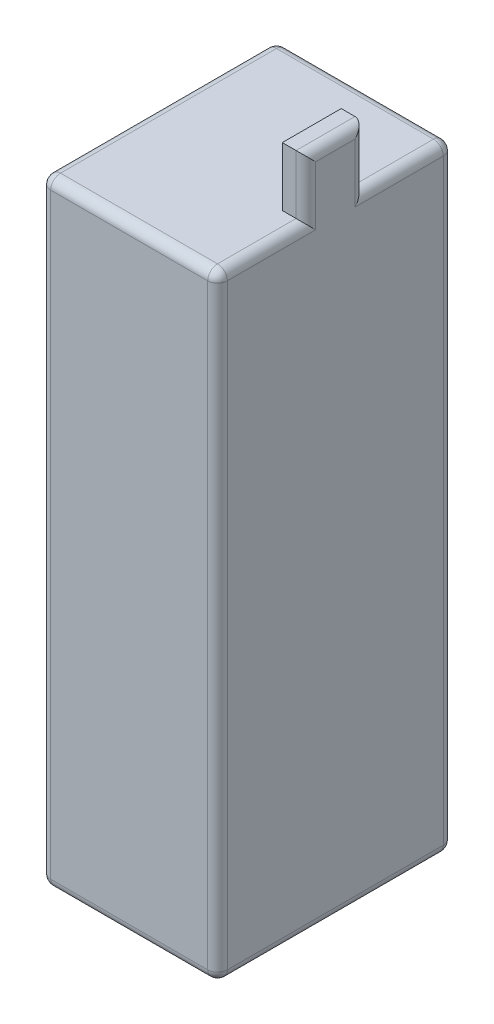
ISO-10303-21;
HEADER;
FILE_DESCRIPTION(('STEP AP214'),'2;1');
FILE_NAME('part.step','',(''),(''),'','','');
FILE_SCHEMA(('AUTOMOTIVE_DESIGN { 1 0 10303 214 1 1 1 1 }'));
ENDSEC;
DATA;
#1=APPLICATION_CONTEXT('core data for automotive mechanical design processes');
#2=APPLICATION_PROTOCOL_DEFINITION('international standard','automotive_design',2000,#1);
#3=PRODUCT_CONTEXT('',#1,'mechanical');
#4=PRODUCT('Part','Part','',(#3));
#5=PRODUCT_RELATED_PRODUCT_CATEGORY('part','',(#4));
#6=PRODUCT_DEFINITION_FORMATION('','',#4);
#7=PRODUCT_DEFINITION_CONTEXT('part definition',#1,'design');
#8=PRODUCT_DEFINITION('design','',#6,#7);
#9=PRODUCT_DEFINITION_SHAPE('','',#8);
#10=(LENGTH_UNIT() NAMED_UNIT(*) SI_UNIT(.MILLI.,.METRE.));
#11=(NAMED_UNIT(*) PLANE_ANGLE_UNIT() SI_UNIT($,.RADIAN.));
#12=(NAMED_UNIT(*) SI_UNIT($,.STERADIAN.) SOLID_ANGLE_UNIT());
#13=UNCERTAINTY_MEASURE_WITH_UNIT(LENGTH_MEASURE(1.E-05),#10,'distance_accuracy_value','');
#14=(GEOMETRIC_REPRESENTATION_CONTEXT(3) GLOBAL_UNCERTAINTY_ASSIGNED_CONTEXT((#13)) GLOBAL_UNIT_ASSIGNED_CONTEXT((#10,
#11,#12)) REPRESENTATION_CONTEXT('',''));
#15=CARTESIAN_POINT('',(0.,0.,0.));
#16=DIRECTION('',(0.,0.,1.));
#17=DIRECTION('',(1.,0.,0.));
#18=AXIS2_PLACEMENT_3D('',#15,#16,#17);
#19=CARTESIAN_POINT('',(0.,157.,0.));
#20=DIRECTION('',(0.,-1.,0.));
#21=DIRECTION('',(0.,0.,-1.));
#22=AXIS2_PLACEMENT_3D('',#19,#20,#21);
#23=PLANE('',#22);
#24=DIRECTION('',(1.,0.,0.));
#25=VECTOR('',#24,1.);
#26=CARTESIAN_POINT('',(0.,157.,-2.5));
#27=LINE('',#26,#25);
#28=CARTESIAN_POINT('',(2.5,157.,-2.5));
#29=VERTEX_POINT('',#28);
#30=CARTESIAN_POINT('',(42.5,157.,-2.5));
#31=VERTEX_POINT('',#30);
#32=EDGE_CURVE('E215',#29,#31,#27,.T.);
#33=ORIENTED_EDGE('',*,*,#32,.T.);
#34=DIRECTION('',(0.,0.,-1.));
#35=VECTOR('',#34,1.);
#36=CARTESIAN_POINT('',(42.5,157.,0.));
#37=LINE('',#36,#35);
#38=CARTESIAN_POINT('',(42.5,157.,-22.5));
#39=VERTEX_POINT('',#38);
#40=EDGE_CURVE('E221',#31,#39,#37,.T.);
#41=ORIENTED_EDGE('',*,*,#40,.T.);
#42=DIRECTION('',(1.,0.,0.));
#43=VECTOR('',#42,1.);
#44=CARTESIAN_POINT('',(45.,157.,-22.5));
#45=LINE('',#44,#43);
#46=CARTESIAN_POINT('',(39.,157.,-22.5));
#47=VERTEX_POINT('',#46);
#48=EDGE_CURVE('E177',#47,#39,#45,.T.);
#49=ORIENTED_EDGE('',*,*,#48,.F.);
#50=DIRECTION('',(0.,0.,1.));
#51=VECTOR('',#50,1.);
#52=CARTESIAN_POINT('',(39.,157.,-22.5));
#53=LINE('',#52,#51);
#54=CARTESIAN_POINT('',(39.,157.,-37.5));
#55=VERTEX_POINT('',#54);
#56=EDGE_CURVE('E202',#55,#47,#53,.T.);
#57=ORIENTED_EDGE('',*,*,#56,.F.);
#58=DIRECTION('',(-1.,0.,0.));
#59=VECTOR('',#58,1.);
#60=CARTESIAN_POINT('',(45.,157.,-37.5));
#61=LINE('',#60,#59);
#62=CARTESIAN_POINT('',(42.5,157.,-37.5));
#63=VERTEX_POINT('',#62);
#64=EDGE_CURVE('E183',#63,#55,#61,.T.);
#65=ORIENTED_EDGE('',*,*,#64,.F.);
#66=DIRECTION('',(0.,0.,-1.));
#67=VECTOR('',#66,1.);
#68=CARTESIAN_POINT('',(42.5,157.,0.));
#69=LINE('',#68,#67);
#70=CARTESIAN_POINT('',(42.5,157.,-57.5));
#71=VERTEX_POINT('',#70);
#72=EDGE_CURVE('E218',#63,#71,#69,.T.);
#73=ORIENTED_EDGE('',*,*,#72,.T.);
#74=DIRECTION('',(-1.,0.,0.));
#75=VECTOR('',#74,1.);
#76=CARTESIAN_POINT('',(0.,157.,-57.5));
#77=LINE('',#76,#75);
#78=CARTESIAN_POINT('',(2.5,157.,-57.5));
#79=VERTEX_POINT('',#78);
#80=EDGE_CURVE('E188',#71,#79,#77,.T.);
#81=ORIENTED_EDGE('',*,*,#80,.T.);
#82=DIRECTION('',(0.,0.,1.));
#83=VECTOR('',#82,1.);
#84=CARTESIAN_POINT('',(2.5,157.,0.));
#85=LINE('',#84,#83);
#86=EDGE_CURVE('E212',#79,#29,#85,.T.);
#87=ORIENTED_EDGE('',*,*,#86,.T.);
#88=EDGE_LOOP('',(#33,#41,#49,#57,#65,#73,#81,#87));
#89=FACE_BOUND('',#88,.T.);
#90=ADVANCED_FACE('F41',(#89),#23,.F.);
#91=CARTESIAN_POINT('',(0.,157.,0.));
#92=DIRECTION('',(1.,0.,0.));
#93=DIRECTION('',(0.,0.,-1.));
#94=AXIS2_PLACEMENT_3D('',#91,#92,#93);
#95=PLANE('',#94);
#96=DIRECTION('',(0.,-1.,0.));
#97=VECTOR('',#96,1.);
#98=CARTESIAN_POINT('',(0.,157.,-2.5));
#99=LINE('',#98,#97);
#100=CARTESIAN_POINT('',(0.,2.5,-2.5));
#101=VERTEX_POINT('',#100);
#102=CARTESIAN_POINT('',(0.,154.5,-2.5));
#103=VERTEX_POINT('',#102);
#104=EDGE_CURVE('E290',#101,#103,#99,.F.);
#105=ORIENTED_EDGE('',*,*,#104,.T.);
#106=DIRECTION('',(0.,0.,1.));
#107=VECTOR('',#106,1.);
#108=CARTESIAN_POINT('',(0.,154.5,0.));
#109=LINE('',#108,#107);
#110=CARTESIAN_POINT('',(0.,154.5,-57.5));
#111=VERTEX_POINT('',#110);
#112=EDGE_CURVE('E293',#103,#111,#109,.F.);
#113=ORIENTED_EDGE('',*,*,#112,.T.);
#114=DIRECTION('',(0.,-1.,0.));
#115=VECTOR('',#114,1.);
#116=CARTESIAN_POINT('',(0.,157.,-57.5));
#117=LINE('',#116,#115);
#118=CARTESIAN_POINT('',(0.,2.5,-57.5));
#119=VERTEX_POINT('',#118);
#120=EDGE_CURVE('E284',#111,#119,#117,.T.);
#121=ORIENTED_EDGE('',*,*,#120,.T.);
#122=DIRECTION('',(0.,0.,1.));
#123=VECTOR('',#122,1.);
#124=CARTESIAN_POINT('',(0.,2.5,0.));
#125=LINE('',#124,#123);
#126=EDGE_CURVE('E287',#119,#101,#125,.T.);
#127=ORIENTED_EDGE('',*,*,#126,.T.);
#128=EDGE_LOOP('',(#105,#113,#121,#127));
#129=FACE_BOUND('',#128,.T.);
#130=ADVANCED_FACE('F455',(#129),#95,.F.);
#131=CARTESIAN_POINT('',(0.,157.,0.));
#132=DIRECTION('',(0.,0.,-1.));
#133=DIRECTION('',(-1.,0.,0.));
#134=AXIS2_PLACEMENT_3D('',#131,#132,#133);
#135=PLANE('',#134);
#136=DIRECTION('',(0.,-1.,0.));
#137=VECTOR('',#136,1.);
#138=CARTESIAN_POINT('',(42.5,157.,0.));
#139=LINE('',#138,#137);
#140=CARTESIAN_POINT('',(42.5,2.5,0.));
#141=VERTEX_POINT('',#140);
#142=CARTESIAN_POINT('',(42.5,154.5,0.));
#143=VERTEX_POINT('',#142);
#144=EDGE_CURVE('E277',#141,#143,#139,.F.);
#145=ORIENTED_EDGE('',*,*,#144,.T.);
#146=DIRECTION('',(1.,0.,0.));
#147=VECTOR('',#146,1.);
#148=CARTESIAN_POINT('',(0.,154.5,0.));
#149=LINE('',#148,#147);
#150=CARTESIAN_POINT('',(2.5,154.5,0.));
#151=VERTEX_POINT('',#150);
#152=EDGE_CURVE('E280',#143,#151,#149,.F.);
#153=ORIENTED_EDGE('',*,*,#152,.T.);
#154=DIRECTION('',(0.,-1.,0.));
#155=VECTOR('',#154,1.);
#156=CARTESIAN_POINT('',(2.5,157.,0.));
#157=LINE('',#156,#155);
#158=CARTESIAN_POINT('',(2.5,2.5,0.));
#159=VERTEX_POINT('',#158);
#160=EDGE_CURVE('E271',#151,#159,#157,.T.);
#161=ORIENTED_EDGE('',*,*,#160,.T.);
#162=DIRECTION('',(1.,0.,0.));
#163=VECTOR('',#162,1.);
#164=CARTESIAN_POINT('',(45.,2.5,0.));
#165=LINE('',#164,#163);
#166=EDGE_CURVE('E274',#159,#141,#165,.T.);
#167=ORIENTED_EDGE('',*,*,#166,.T.);
#168=EDGE_LOOP('',(#145,#153,#161,#167));
#169=FACE_BOUND('',#168,.T.);
#170=ADVANCED_FACE('F451',(#169),#135,.F.);
#171=CARTESIAN_POINT('',(45.,157.,0.));
#172=DIRECTION('',(-1.,0.,0.));
#173=DIRECTION('',(0.,0.,1.));
#174=AXIS2_PLACEMENT_3D('',#171,#172,#173);
#175=PLANE('',#174);
#176=DIRECTION('',(0.,0.,-1.));
#177=VECTOR('',#176,1.);
#178=CARTESIAN_POINT('',(45.,154.5,0.));
#179=LINE('',#178,#177);
#180=CARTESIAN_POINT('',(45.,154.5,-25.));
#181=VERTEX_POINT('',#180);
#182=CARTESIAN_POINT('',(45.,154.5,-2.5));
#183=VERTEX_POINT('',#182);
#184=EDGE_CURVE('E243',#181,#183,#179,.F.);
#185=ORIENTED_EDGE('',*,*,#184,.T.);
#186=DIRECTION('',(0.,-1.,0.));
#187=VECTOR('',#186,1.);
#188=CARTESIAN_POINT('',(45.,157.,-2.5));
#189=LINE('',#188,#187);
#190=CARTESIAN_POINT('',(45.,2.5,-2.5));
#191=VERTEX_POINT('',#190);
#192=EDGE_CURVE('E247',#183,#191,#189,.T.);
#193=ORIENTED_EDGE('',*,*,#192,.T.);
#194=DIRECTION('',(0.,0.,-1.));
#195=VECTOR('',#194,1.);
#196=CARTESIAN_POINT('',(45.,2.5,-60.));
#197=LINE('',#196,#195);
#198=CARTESIAN_POINT('',(45.,2.5,-57.5));
#199=VERTEX_POINT('',#198);
#200=EDGE_CURVE('E228',#191,#199,#197,.T.);
#201=ORIENTED_EDGE('',*,*,#200,.T.);
#202=DIRECTION('',(0.,-1.,0.));
#203=VECTOR('',#202,1.);
#204=CARTESIAN_POINT('',(45.,157.,-57.5));
#205=LINE('',#204,#203);
#206=CARTESIAN_POINT('',(45.,154.5,-57.5));
#207=VERTEX_POINT('',#206);
#208=EDGE_CURVE('E225',#199,#207,#205,.F.);
#209=ORIENTED_EDGE('',*,*,#208,.T.);
#210=DIRECTION('',(0.,0.,-1.));
#211=VECTOR('',#210,1.);
#212=CARTESIAN_POINT('',(45.,154.5,0.));
#213=LINE('',#212,#211);
#214=CARTESIAN_POINT('',(45.,154.5,-35.));
#215=VERTEX_POINT('',#214);
#216=EDGE_CURVE('E231',#207,#215,#213,.F.);
#217=ORIENTED_EDGE('',*,*,#216,.T.);
#218=DIRECTION('',(0.,-1.,0.));
#219=VECTOR('',#218,1.);
#220=CARTESIAN_POINT('',(45.,157.,-35.));
#221=LINE('',#220,#219);
#222=CARTESIAN_POINT('',(45.,169.5,-35.));
#223=VERTEX_POINT('',#222);
#224=EDGE_CURVE('E234',#215,#223,#221,.F.);
#225=ORIENTED_EDGE('',*,*,#224,.T.);
#226=DIRECTION('',(0.,0.,-1.));
#227=VECTOR('',#226,1.);
#228=CARTESIAN_POINT('',(45.,169.5,-22.5));
#229=LINE('',#228,#227);
#230=CARTESIAN_POINT('',(45.,169.5,-25.));
#231=VERTEX_POINT('',#230);
#232=EDGE_CURVE('E237',#223,#231,#229,.F.);
#233=ORIENTED_EDGE('',*,*,#232,.T.);
#234=DIRECTION('',(0.,-1.,0.));
#235=VECTOR('',#234,1.);
#236=CARTESIAN_POINT('',(45.,157.,-25.));
#237=LINE('',#236,#235);
#238=EDGE_CURVE('E240',#231,#181,#237,.T.);
#239=ORIENTED_EDGE('',*,*,#238,.T.);
#240=EDGE_LOOP('',(#185,#193,#201,#209,#217,#225,#233,#239));
#241=FACE_BOUND('',#240,.T.);
#242=ADVANCED_FACE('F443',(#241),#175,.F.);
#243=CARTESIAN_POINT('',(0.,157.,-60.));
#244=DIRECTION('',(0.,0.,1.));
#245=DIRECTION('',(1.,0.,0.));
#246=AXIS2_PLACEMENT_3D('',#243,#244,#245);
#247=PLANE('',#246);
#248=DIRECTION('',(-1.,0.,0.));
#249=VECTOR('',#248,1.);
#250=CARTESIAN_POINT('',(0.,154.5,-60.));
#251=LINE('',#250,#249);
#252=CARTESIAN_POINT('',(2.5,154.5,-60.));
#253=VERTEX_POINT('',#252);
#254=CARTESIAN_POINT('',(42.5,154.5,-60.));
#255=VERTEX_POINT('',#254);
#256=EDGE_CURVE('E51',#253,#255,#251,.F.);
#257=ORIENTED_EDGE('',*,*,#256,.T.);
#258=DIRECTION('',(0.,-1.,0.));
#259=VECTOR('',#258,1.);
#260=CARTESIAN_POINT('',(42.5,157.,-60.));
#261=LINE('',#260,#259);
#262=CARTESIAN_POINT('',(42.5,2.5,-60.));
#263=VERTEX_POINT('',#262);
#264=EDGE_CURVE('E11',#255,#263,#261,.T.);
#265=ORIENTED_EDGE('',*,*,#264,.T.);
#266=DIRECTION('',(-1.,0.,0.));
#267=VECTOR('',#266,1.);
#268=CARTESIAN_POINT('',(0.,2.5,-60.));
#269=LINE('',#268,#267);
#270=CARTESIAN_POINT('',(2.5,2.5,-60.));
#271=VERTEX_POINT('',#270);
#272=EDGE_CURVE('E297',#263,#271,#269,.T.);
#273=ORIENTED_EDGE('',*,*,#272,.T.);
#274=DIRECTION('',(0.,-1.,0.));
#275=VECTOR('',#274,1.);
#276=CARTESIAN_POINT('',(2.5,157.,-60.));
#277=LINE('',#276,#275);
#278=EDGE_CURVE('E62',#271,#253,#277,.F.);
#279=ORIENTED_EDGE('',*,*,#278,.T.);
#280=EDGE_LOOP('',(#257,#265,#273,#279));
#281=FACE_BOUND('',#280,.T.);
#282=ADVANCED_FACE('F440',(#281),#247,.F.);
#283=CARTESIAN_POINT('',(0.,0.,0.));
#284=DIRECTION('',(0.,-1.,0.));
#285=DIRECTION('',(0.,0.,-1.));
#286=AXIS2_PLACEMENT_3D('',#283,#284,#285);
#287=PLANE('',#286);
#288=DIRECTION('',(-1.,0.,0.));
#289=VECTOR('',#288,1.);
#290=CARTESIAN_POINT('',(45.,0.,-57.5));
#291=LINE('',#290,#289);
#292=CARTESIAN_POINT('',(2.5,0.,-57.5));
#293=VERTEX_POINT('',#292);
#294=CARTESIAN_POINT('',(42.5,0.,-57.5));
#295=VERTEX_POINT('',#294);
#296=EDGE_CURVE('E258',#293,#295,#291,.F.);
#297=ORIENTED_EDGE('',*,*,#296,.T.);
#298=DIRECTION('',(0.,0.,-1.));
#299=VECTOR('',#298,1.);
#300=CARTESIAN_POINT('',(42.5,0.,0.));
#301=LINE('',#300,#299);
#302=CARTESIAN_POINT('',(42.5,0.,-2.5));
#303=VERTEX_POINT('',#302);
#304=EDGE_CURVE('E267',#295,#303,#301,.F.);
#305=ORIENTED_EDGE('',*,*,#304,.T.);
#306=DIRECTION('',(1.,0.,0.));
#307=VECTOR('',#306,1.);
#308=CARTESIAN_POINT('',(0.,0.,-2.5));
#309=LINE('',#308,#307);
#310=CARTESIAN_POINT('',(2.5,0.,-2.5));
#311=VERTEX_POINT('',#310);
#312=EDGE_CURVE('E264',#303,#311,#309,.F.);
#313=ORIENTED_EDGE('',*,*,#312,.T.);
#314=DIRECTION('',(0.,0.,1.));
#315=VECTOR('',#314,1.);
#316=CARTESIAN_POINT('',(2.5,0.,-60.));
#317=LINE('',#316,#315);
#318=EDGE_CURVE('E261',#311,#293,#317,.F.);
#319=ORIENTED_EDGE('',*,*,#318,.T.);
#320=EDGE_LOOP('',(#297,#305,#313,#319));
#321=FACE_BOUND('',#320,.T.);
#322=ADVANCED_FACE('F442',(#321),#287,.T.);
#323=CARTESIAN_POINT('',(45.,172.,-37.5));
#324=DIRECTION('',(0.,0.,1.));
#325=DIRECTION('',(1.,0.,0.));
#326=AXIS2_PLACEMENT_3D('',#323,#324,#325);
#327=PLANE('',#326);
#328=DIRECTION('',(-1.,0.,0.));
#329=VECTOR('',#328,1.);
#330=CARTESIAN_POINT('',(45.,172.,-37.5));
#331=LINE('',#330,#329);
#332=CARTESIAN_POINT('',(42.5,172.,-37.5));
#333=VERTEX_POINT('',#332);
#334=CARTESIAN_POINT('',(39.,172.,-37.5));
#335=VERTEX_POINT('',#334);
#336=EDGE_CURVE('E165',#333,#335,#331,.T.);
#337=ORIENTED_EDGE('',*,*,#336,.F.);
#338=DIRECTION('',(0.,-1.,0.));
#339=VECTOR('',#338,1.);
#340=CARTESIAN_POINT('',(42.5,172.,-37.5));
#341=LINE('',#340,#339);
#342=EDGE_CURVE('E255',#333,#63,#341,.T.);
#343=ORIENTED_EDGE('',*,*,#342,.T.);
#344=ORIENTED_EDGE('',*,*,#64,.T.);
#345=DIRECTION('',(0.,-1.,0.));
#346=VECTOR('',#345,1.);
#347=CARTESIAN_POINT('',(39.,172.,-37.5));
#348=LINE('',#347,#346);
#349=EDGE_CURVE('E180',#335,#55,#348,.T.);
#350=ORIENTED_EDGE('',*,*,#349,.F.);
#351=EDGE_LOOP('',(#337,#343,#344,#350));
#352=FACE_BOUND('',#351,.T.);
#353=ADVANCED_FACE('F181',(#352),#327,.F.);
#354=CARTESIAN_POINT('',(39.,172.,-22.5));
#355=DIRECTION('',(1.,0.,0.));
#356=DIRECTION('',(0.,0.,-1.));
#357=AXIS2_PLACEMENT_3D('',#354,#355,#356);
#358=PLANE('',#357);
#359=ORIENTED_EDGE('',*,*,#56,.T.);
#360=DIRECTION('',(0.,-1.,0.));
#361=VECTOR('',#360,1.);
#362=CARTESIAN_POINT('',(39.,172.,-22.5));
#363=LINE('',#362,#361);
#364=CARTESIAN_POINT('',(39.,172.,-22.5));
#365=VERTEX_POINT('',#364);
#366=EDGE_CURVE('E189',#365,#47,#363,.T.);
#367=ORIENTED_EDGE('',*,*,#366,.F.);
#368=DIRECTION('',(0.,0.,1.));
#369=VECTOR('',#368,1.);
#370=CARTESIAN_POINT('',(39.,172.,-22.5));
#371=LINE('',#370,#369);
#372=EDGE_CURVE('E170',#335,#365,#371,.T.);
#373=ORIENTED_EDGE('',*,*,#372,.F.);
#374=ORIENTED_EDGE('',*,*,#349,.T.);
#375=EDGE_LOOP('',(#359,#367,#373,#374));
#376=FACE_BOUND('',#375,.T.);
#377=ADVANCED_FACE('F191',(#376),#358,.F.);
#378=CARTESIAN_POINT('',(45.,172.,-22.5));
#379=DIRECTION('',(0.,0.,-1.));
#380=DIRECTION('',(-1.,0.,0.));
#381=AXIS2_PLACEMENT_3D('',#378,#379,#380);
#382=PLANE('',#381);
#383=ORIENTED_EDGE('',*,*,#48,.T.);
#384=DIRECTION('',(0.,-1.,0.));
#385=VECTOR('',#384,1.);
#386=CARTESIAN_POINT('',(42.5,172.,-22.5));
#387=LINE('',#386,#385);
#388=CARTESIAN_POINT('',(42.5,172.,-22.5));
#389=VERTEX_POINT('',#388);
#390=EDGE_CURVE('E250',#39,#389,#387,.F.);
#391=ORIENTED_EDGE('',*,*,#390,.T.);
#392=DIRECTION('',(1.,0.,0.));
#393=VECTOR('',#392,1.);
#394=CARTESIAN_POINT('',(45.,172.,-22.5));
#395=LINE('',#394,#393);
#396=EDGE_CURVE('E195',#365,#389,#395,.T.);
#397=ORIENTED_EDGE('',*,*,#396,.F.);
#398=ORIENTED_EDGE('',*,*,#366,.T.);
#399=EDGE_LOOP('',(#383,#391,#397,#398));
#400=FACE_BOUND('',#399,.T.);
#401=ADVANCED_FACE('F468',(#400),#382,.F.);
#402=CARTESIAN_POINT('',(0.,172.,0.));
#403=DIRECTION('',(0.,1.,0.));
#404=DIRECTION('',(0.,0.,1.));
#405=AXIS2_PLACEMENT_3D('',#402,#403,#404);
#406=PLANE('',#405);
#407=ORIENTED_EDGE('',*,*,#396,.T.);
#408=DIRECTION('',(0.,0.,-1.));
#409=VECTOR('',#408,1.);
#410=CARTESIAN_POINT('',(42.5,172.,-37.5));
#411=LINE('',#410,#409);
#412=EDGE_CURVE('E173',#389,#333,#411,.T.);
#413=ORIENTED_EDGE('',*,*,#412,.T.);
#414=ORIENTED_EDGE('',*,*,#336,.T.);
#415=ORIENTED_EDGE('',*,*,#372,.T.);
#416=EDGE_LOOP('',(#407,#413,#414,#415));
#417=FACE_BOUND('',#416,.T.);
#418=ADVANCED_FACE('F168',(#417),#406,.T.);
#419=CARTESIAN_POINT('',(2.5,2.5,-57.5));
#420=DIRECTION('',(0.,0.,1.));
#421=DIRECTION('',(1.,0.,0.));
#422=AXIS2_PLACEMENT_3D('',#419,#420,#421);
#423=SPHERICAL_SURFACE('',#422,2.5);
#424=CARTESIAN_POINT('',(2.5,2.5,-57.5));
#425=DIRECTION('',(0.,-1.,0.));
#426=DIRECTION('',(0.,0.,-1.));
#427=AXIS2_PLACEMENT_3D('',#424,#425,#426);
#428=CIRCLE('',#427,2.5);
#429=EDGE_CURVE('E398',#271,#119,#428,.F.);
#430=ORIENTED_EDGE('',*,*,#429,.F.);
#431=CARTESIAN_POINT('',(2.5,2.5,-57.5));
#432=DIRECTION('',(-1.,0.,0.));
#433=DIRECTION('',(0.,0.,1.));
#434=AXIS2_PLACEMENT_3D('',#431,#432,#433);
#435=CIRCLE('',#434,2.5);
#436=EDGE_CURVE('E45',#293,#271,#435,.F.);
#437=ORIENTED_EDGE('',*,*,#436,.F.);
#438=CARTESIAN_POINT('',(2.5,2.5,-57.5));
#439=DIRECTION('',(0.,0.,-1.));
#440=DIRECTION('',(-1.,0.,0.));
#441=AXIS2_PLACEMENT_3D('',#438,#439,#440);
#442=CIRCLE('',#441,2.5);
#443=EDGE_CURVE('E401',#119,#293,#442,.F.);
#444=ORIENTED_EDGE('',*,*,#443,.F.);
#445=EDGE_LOOP('',(#430,#437,#444));
#446=FACE_BOUND('',#445,.T.);
#447=ADVANCED_FACE('F43',(#446),#423,.T.);
#448=CARTESIAN_POINT('',(0.,2.5,-57.5));
#449=DIRECTION('',(1.,0.,0.));
#450=DIRECTION('',(0.,0.,-1.));
#451=AXIS2_PLACEMENT_3D('',#448,#449,#450);
#452=CYLINDRICAL_SURFACE('',#451,2.5);
#453=ORIENTED_EDGE('',*,*,#436,.T.);
#454=ORIENTED_EDGE('',*,*,#272,.F.);
#455=CARTESIAN_POINT('',(42.5,2.5,-57.5));
#456=DIRECTION('',(1.,0.,0.));
#457=DIRECTION('',(0.,0.,-1.));
#458=AXIS2_PLACEMENT_3D('',#455,#456,#457);
#459=CIRCLE('',#458,2.5);
#460=EDGE_CURVE('E391',#295,#263,#459,.T.);
#461=ORIENTED_EDGE('',*,*,#460,.F.);
#462=ORIENTED_EDGE('',*,*,#296,.F.);
#463=EDGE_LOOP('',(#453,#454,#461,#462));
#464=FACE_BOUND('',#463,.T.);
#465=ADVANCED_FACE('F415',(#464),#452,.T.);
#466=CARTESIAN_POINT('',(2.5,2.5,0.));
#467=DIRECTION('',(0.,0.,-1.));
#468=DIRECTION('',(-1.,0.,0.));
#469=AXIS2_PLACEMENT_3D('',#466,#467,#468);
#470=CYLINDRICAL_SURFACE('',#469,2.5);
#471=ORIENTED_EDGE('',*,*,#443,.T.);
#472=ORIENTED_EDGE('',*,*,#318,.F.);
#473=CARTESIAN_POINT('',(2.5,2.5,-2.5));
#474=DIRECTION('',(0.,0.,1.));
#475=DIRECTION('',(1.,0.,0.));
#476=AXIS2_PLACEMENT_3D('',#473,#474,#475);
#477=CIRCLE('',#476,2.5);
#478=EDGE_CURVE('E387',#101,#311,#477,.T.);
#479=ORIENTED_EDGE('',*,*,#478,.F.);
#480=ORIENTED_EDGE('',*,*,#126,.F.);
#481=EDGE_LOOP('',(#471,#472,#479,#480));
#482=FACE_BOUND('',#481,.T.);
#483=ADVANCED_FACE('F479',(#482),#470,.T.);
#484=CARTESIAN_POINT('',(2.5,157.,-57.5));
#485=DIRECTION('',(0.,-1.,0.));
#486=DIRECTION('',(0.,0.,-1.));
#487=AXIS2_PLACEMENT_3D('',#484,#485,#486);
#488=CYLINDRICAL_SURFACE('',#487,2.5);
#489=ORIENTED_EDGE('',*,*,#429,.T.);
#490=ORIENTED_EDGE('',*,*,#120,.F.);
#491=CARTESIAN_POINT('',(2.5,154.5,-57.5));
#492=DIRECTION('',(0.,1.,0.));
#493=DIRECTION('',(0.,0.,1.));
#494=AXIS2_PLACEMENT_3D('',#491,#492,#493);
#495=CIRCLE('',#494,2.5);
#496=EDGE_CURVE('E383',#253,#111,#495,.T.);
#497=ORIENTED_EDGE('',*,*,#496,.F.);
#498=ORIENTED_EDGE('',*,*,#278,.F.);
#499=EDGE_LOOP('',(#489,#490,#497,#498));
#500=FACE_BOUND('',#499,.T.);
#501=ADVANCED_FACE('F421',(#500),#488,.T.);
#502=CARTESIAN_POINT('',(0.,154.5,-57.5));
#503=DIRECTION('',(-1.,0.,0.));
#504=DIRECTION('',(0.,0.,1.));
#505=AXIS2_PLACEMENT_3D('',#502,#503,#504);
#506=CYLINDRICAL_SURFACE('',#505,2.5);
#507=CARTESIAN_POINT('',(42.5,154.5,-57.5));
#508=DIRECTION('',(1.,0.,0.));
#509=DIRECTION('',(0.,0.,-1.));
#510=AXIS2_PLACEMENT_3D('',#507,#508,#509);
#511=CIRCLE('',#510,2.5);
#512=EDGE_CURVE('E375',#255,#71,#511,.T.);
#513=ORIENTED_EDGE('',*,*,#512,.F.);
#514=ORIENTED_EDGE('',*,*,#256,.F.);
#515=CARTESIAN_POINT('',(2.5,154.5,-57.5));
#516=DIRECTION('',(-1.,0.,0.));
#517=DIRECTION('',(0.,0.,1.));
#518=AXIS2_PLACEMENT_3D('',#515,#516,#517);
#519=CIRCLE('',#518,2.5);
#520=EDGE_CURVE('E379',#79,#253,#519,.T.);
#521=ORIENTED_EDGE('',*,*,#520,.F.);
#522=ORIENTED_EDGE('',*,*,#80,.F.);
#523=EDGE_LOOP('',(#513,#514,#521,#522));
#524=FACE_BOUND('',#523,.T.);
#525=ADVANCED_FACE('F430',(#524),#506,.T.);
#526=CARTESIAN_POINT('',(42.5,157.,-57.5));
#527=DIRECTION('',(0.,-1.,0.));
#528=DIRECTION('',(0.,0.,-1.));
#529=AXIS2_PLACEMENT_3D('',#526,#527,#528);
#530=CYLINDRICAL_SURFACE('',#529,2.5);
#531=CARTESIAN_POINT('',(42.5,2.5,-57.5));
#532=DIRECTION('',(0.,-1.,0.));
#533=DIRECTION('',(0.,0.,-1.));
#534=AXIS2_PLACEMENT_3D('',#531,#532,#533);
#535=CIRCLE('',#534,2.5);
#536=EDGE_CURVE('E394',#263,#199,#535,.T.);
#537=ORIENTED_EDGE('',*,*,#536,.F.);
#538=ORIENTED_EDGE('',*,*,#264,.F.);
#539=CARTESIAN_POINT('',(42.5,154.5,-57.5));
#540=DIRECTION('',(0.,1.,0.));
#541=DIRECTION('',(0.,0.,1.));
#542=AXIS2_PLACEMENT_3D('',#539,#540,#541);
#543=CIRCLE('',#542,2.5);
#544=EDGE_CURVE('E371',#207,#255,#543,.T.);
#545=ORIENTED_EDGE('',*,*,#544,.F.);
#546=ORIENTED_EDGE('',*,*,#208,.F.);
#547=EDGE_LOOP('',(#537,#538,#545,#546));
#548=FACE_BOUND('',#547,.T.);
#549=ADVANCED_FACE('F439',(#548),#530,.T.);
#550=CARTESIAN_POINT('',(42.5,2.5,-57.5));
#551=DIRECTION('',(0.,0.,1.));
#552=DIRECTION('',(1.,0.,0.));
#553=AXIS2_PLACEMENT_3D('',#550,#551,#552);
#554=SPHERICAL_SURFACE('',#553,2.5);
#555=ORIENTED_EDGE('',*,*,#460,.T.);
#556=ORIENTED_EDGE('',*,*,#536,.T.);
#557=CARTESIAN_POINT('',(42.5,2.5,-57.5));
#558=DIRECTION('',(0.,0.,-1.));
#559=DIRECTION('',(-1.,0.,0.));
#560=AXIS2_PLACEMENT_3D('',#557,#558,#559);
#561=CIRCLE('',#560,2.5);
#562=EDGE_CURVE('E367',#295,#199,#561,.F.);
#563=ORIENTED_EDGE('',*,*,#562,.F.);
#564=EDGE_LOOP('',(#555,#556,#563));
#565=FACE_BOUND('',#564,.T.);
#566=ADVANCED_FACE('F491',(#565),#554,.T.);
#567=CARTESIAN_POINT('',(2.5,2.5,-2.5));
#568=DIRECTION('',(0.,0.,1.));
#569=DIRECTION('',(1.,0.,0.));
#570=AXIS2_PLACEMENT_3D('',#567,#568,#569);
#571=SPHERICAL_SURFACE('',#570,2.5);
#572=CARTESIAN_POINT('',(2.5,2.5,-2.5));
#573=DIRECTION('',(0.,-1.,0.));
#574=DIRECTION('',(0.,0.,-1.));
#575=AXIS2_PLACEMENT_3D('',#572,#573,#574);
#576=CIRCLE('',#575,2.5);
#577=EDGE_CURVE('E359',#101,#159,#576,.F.);
#578=ORIENTED_EDGE('',*,*,#577,.F.);
#579=ORIENTED_EDGE('',*,*,#478,.T.);
#580=CARTESIAN_POINT('',(2.5,2.5,-2.5));
#581=DIRECTION('',(-1.,0.,0.));
#582=DIRECTION('',(0.,0.,1.));
#583=AXIS2_PLACEMENT_3D('',#580,#581,#582);
#584=CIRCLE('',#583,2.5);
#585=EDGE_CURVE('E363',#159,#311,#584,.F.);
#586=ORIENTED_EDGE('',*,*,#585,.F.);
#587=EDGE_LOOP('',(#578,#579,#586));
#588=FACE_BOUND('',#587,.T.);
#589=ADVANCED_FACE('F494',(#588),#571,.T.);
#590=CARTESIAN_POINT('',(2.5,154.5,-57.5));
#591=DIRECTION('',(0.,0.,1.));
#592=DIRECTION('',(1.,0.,0.));
#593=AXIS2_PLACEMENT_3D('',#590,#591,#592);
#594=SPHERICAL_SURFACE('',#593,2.5);
#595=ORIENTED_EDGE('',*,*,#520,.T.);
#596=ORIENTED_EDGE('',*,*,#496,.T.);
#597=CARTESIAN_POINT('',(2.5,154.5,-57.5));
#598=DIRECTION('',(0.,0.,-1.));
#599=DIRECTION('',(-1.,0.,0.));
#600=AXIS2_PLACEMENT_3D('',#597,#598,#599);
#601=CIRCLE('',#600,2.5);
#602=EDGE_CURVE('E356',#79,#111,#601,.F.);
#603=ORIENTED_EDGE('',*,*,#602,.F.);
#604=EDGE_LOOP('',(#595,#596,#603));
#605=FACE_BOUND('',#604,.T.);
#606=ADVANCED_FACE('F425',(#605),#594,.T.);
#607=CARTESIAN_POINT('',(42.5,154.5,-57.5));
#608=DIRECTION('',(0.,0.,1.));
#609=DIRECTION('',(1.,0.,0.));
#610=AXIS2_PLACEMENT_3D('',#607,#608,#609);
#611=SPHERICAL_SURFACE('',#610,2.5);
#612=ORIENTED_EDGE('',*,*,#544,.T.);
#613=ORIENTED_EDGE('',*,*,#512,.T.);
#614=CARTESIAN_POINT('',(42.5,154.5,-57.5));
#615=DIRECTION('',(0.,0.,-1.));
#616=DIRECTION('',(-1.,0.,0.));
#617=AXIS2_PLACEMENT_3D('',#614,#615,#616);
#618=CIRCLE('',#617,2.5);
#619=EDGE_CURVE('E352',#207,#71,#618,.F.);
#620=ORIENTED_EDGE('',*,*,#619,.F.);
#621=EDGE_LOOP('',(#612,#613,#620));
#622=FACE_BOUND('',#621,.T.);
#623=ADVANCED_FACE('F434',(#622),#611,.T.);
#624=CARTESIAN_POINT('',(42.5,2.5,0.));
#625=DIRECTION('',(0.,0.,1.));
#626=DIRECTION('',(1.,0.,0.));
#627=AXIS2_PLACEMENT_3D('',#624,#625,#626);
#628=CYLINDRICAL_SURFACE('',#627,2.5);
#629=ORIENTED_EDGE('',*,*,#562,.T.);
#630=ORIENTED_EDGE('',*,*,#200,.F.);
#631=CARTESIAN_POINT('',(42.5,2.5,-2.5));
#632=DIRECTION('',(0.,0.,1.));
#633=DIRECTION('',(1.,0.,0.));
#634=AXIS2_PLACEMENT_3D('',#631,#632,#633);
#635=CIRCLE('',#634,2.5);
#636=EDGE_CURVE('E348',#303,#191,#635,.T.);
#637=ORIENTED_EDGE('',*,*,#636,.F.);
#638=ORIENTED_EDGE('',*,*,#304,.F.);
#639=EDGE_LOOP('',(#629,#630,#637,#638));
#640=FACE_BOUND('',#639,.T.);
#641=ADVANCED_FACE('F503',(#640),#628,.T.);
#642=CARTESIAN_POINT('',(0.,2.5,-2.5));
#643=DIRECTION('',(-1.,0.,0.));
#644=DIRECTION('',(0.,0.,1.));
#645=AXIS2_PLACEMENT_3D('',#642,#643,#644);
#646=CYLINDRICAL_SURFACE('',#645,2.5);
#647=ORIENTED_EDGE('',*,*,#585,.T.);
#648=ORIENTED_EDGE('',*,*,#312,.F.);
#649=CARTESIAN_POINT('',(42.5,2.5,-2.5));
#650=DIRECTION('',(1.,0.,0.));
#651=DIRECTION('',(0.,0.,-1.));
#652=AXIS2_PLACEMENT_3D('',#649,#650,#651);
#653=CIRCLE('',#652,2.5);
#654=EDGE_CURVE('E345',#141,#303,#653,.T.);
#655=ORIENTED_EDGE('',*,*,#654,.F.);
#656=ORIENTED_EDGE('',*,*,#166,.F.);
#657=EDGE_LOOP('',(#647,#648,#655,#656));
#658=FACE_BOUND('',#657,.T.);
#659=ADVANCED_FACE('F506',(#658),#646,.T.);
#660=CARTESIAN_POINT('',(2.5,157.,-2.5));
#661=DIRECTION('',(0.,-1.,0.));
#662=DIRECTION('',(0.,0.,-1.));
#663=AXIS2_PLACEMENT_3D('',#660,#661,#662);
#664=CYLINDRICAL_SURFACE('',#663,2.5);
#665=ORIENTED_EDGE('',*,*,#577,.T.);
#666=ORIENTED_EDGE('',*,*,#160,.F.);
#667=CARTESIAN_POINT('',(2.5,154.5,-2.5));
#668=DIRECTION('',(0.,1.,0.));
#669=DIRECTION('',(0.,0.,1.));
#670=AXIS2_PLACEMENT_3D('',#667,#668,#669);
#671=CIRCLE('',#670,2.5);
#672=EDGE_CURVE('E341',#103,#151,#671,.T.);
#673=ORIENTED_EDGE('',*,*,#672,.F.);
#674=ORIENTED_EDGE('',*,*,#104,.F.);
#675=EDGE_LOOP('',(#665,#666,#673,#674));
#676=FACE_BOUND('',#675,.T.);
#677=ADVANCED_FACE('F510',(#676),#664,.T.);
#678=CARTESIAN_POINT('',(2.5,154.5,0.));
#679=DIRECTION('',(0.,0.,1.));
#680=DIRECTION('',(1.,0.,0.));
#681=AXIS2_PLACEMENT_3D('',#678,#679,#680);
#682=CYLINDRICAL_SURFACE('',#681,2.5);
#683=ORIENTED_EDGE('',*,*,#602,.T.);
#684=ORIENTED_EDGE('',*,*,#112,.F.);
#685=CARTESIAN_POINT('',(2.5,154.5,-2.5));
#686=DIRECTION('',(0.,0.,1.));
#687=DIRECTION('',(1.,0.,0.));
#688=AXIS2_PLACEMENT_3D('',#685,#686,#687);
#689=CIRCLE('',#688,2.5);
#690=EDGE_CURVE('E337',#29,#103,#689,.T.);
#691=ORIENTED_EDGE('',*,*,#690,.F.);
#692=ORIENTED_EDGE('',*,*,#86,.F.);
#693=EDGE_LOOP('',(#683,#684,#691,#692));
#694=FACE_BOUND('',#693,.T.);
#695=ADVANCED_FACE('F514',(#694),#682,.T.);
#696=CARTESIAN_POINT('',(42.5,154.5,0.));
#697=DIRECTION('',(0.,0.,-1.));
#698=DIRECTION('',(-1.,0.,0.));
#699=AXIS2_PLACEMENT_3D('',#696,#697,#698);
#700=CYLINDRICAL_SURFACE('',#699,2.5);
#701=ORIENTED_EDGE('',*,*,#619,.T.);
#702=ORIENTED_EDGE('',*,*,#72,.F.);
#703=CARTESIAN_POINT('',(42.5,154.5,-35.));
#704=DIRECTION('',(0.,-0.707106781186547,-0.707106781186547));
#705=DIRECTION('',(0.,-0.707106781186547,0.707106781186547));
#706=AXIS2_PLACEMENT_3D('',#703,#704,#705);
#707=ELLIPSE('',#706,3.53553390593274,2.5);
#708=EDGE_CURVE('E333',#215,#63,#707,.F.);
#709=ORIENTED_EDGE('',*,*,#708,.F.);
#710=ORIENTED_EDGE('',*,*,#216,.F.);
#711=EDGE_LOOP('',(#701,#702,#709,#710));
#712=FACE_BOUND('',#711,.T.);
#713=ADVANCED_FACE('F518',(#712),#700,.T.);
#714=CARTESIAN_POINT('',(42.5,2.5,-2.5));
#715=DIRECTION('',(0.,0.,1.));
#716=DIRECTION('',(1.,0.,0.));
#717=AXIS2_PLACEMENT_3D('',#714,#715,#716);
#718=SPHERICAL_SURFACE('',#717,2.5);
#719=ORIENTED_EDGE('',*,*,#654,.T.);
#720=ORIENTED_EDGE('',*,*,#636,.T.);
#721=CARTESIAN_POINT('',(42.5,2.5,-2.5));
#722=DIRECTION('',(0.,-1.,0.));
#723=DIRECTION('',(0.,0.,-1.));
#724=AXIS2_PLACEMENT_3D('',#721,#722,#723);
#725=CIRCLE('',#724,2.5);
#726=EDGE_CURVE('E329',#141,#191,#725,.F.);
#727=ORIENTED_EDGE('',*,*,#726,.F.);
#728=EDGE_LOOP('',(#719,#720,#727));
#729=FACE_BOUND('',#728,.T.);
#730=ADVANCED_FACE('F522',(#729),#718,.T.);
#731=CARTESIAN_POINT('',(2.5,154.5,-2.5));
#732=DIRECTION('',(0.,0.,1.));
#733=DIRECTION('',(1.,0.,0.));
#734=AXIS2_PLACEMENT_3D('',#731,#732,#733);
#735=SPHERICAL_SURFACE('',#734,2.5);
#736=ORIENTED_EDGE('',*,*,#690,.T.);
#737=ORIENTED_EDGE('',*,*,#672,.T.);
#738=CARTESIAN_POINT('',(2.5,154.5,-2.5));
#739=DIRECTION('',(-1.,0.,0.));
#740=DIRECTION('',(0.,0.,1.));
#741=AXIS2_PLACEMENT_3D('',#738,#739,#740);
#742=CIRCLE('',#741,2.5);
#743=EDGE_CURVE('E326',#29,#151,#742,.F.);
#744=ORIENTED_EDGE('',*,*,#743,.F.);
#745=EDGE_LOOP('',(#736,#737,#744));
#746=FACE_BOUND('',#745,.T.);
#747=ADVANCED_FACE('F526',(#746),#735,.T.);
#748=CARTESIAN_POINT('',(42.5,172.,-35.));
#749=DIRECTION('',(0.,-1.,0.));
#750=DIRECTION('',(0.,0.,-1.));
#751=AXIS2_PLACEMENT_3D('',#748,#749,#750);
#752=CYLINDRICAL_SURFACE('',#751,2.5);
#753=ORIENTED_EDGE('',*,*,#708,.T.);
#754=ORIENTED_EDGE('',*,*,#342,.F.);
#755=CARTESIAN_POINT('',(42.5,169.5,-35.));
#756=DIRECTION('',(0.,-0.707106781186547,-0.707106781186547));
#757=DIRECTION('',(0.,-0.707106781186547,0.707106781186547));
#758=AXIS2_PLACEMENT_3D('',#755,#756,#757);
#759=ELLIPSE('',#758,3.53553390593274,2.5);
#760=EDGE_CURVE('E322',#223,#333,#759,.F.);
#761=ORIENTED_EDGE('',*,*,#760,.F.);
#762=ORIENTED_EDGE('',*,*,#224,.F.);
#763=EDGE_LOOP('',(#753,#754,#761,#762));
#764=FACE_BOUND('',#763,.T.);
#765=ADVANCED_FACE('F530',(#764),#752,.T.);
#766=CARTESIAN_POINT('',(42.5,157.,-2.5));
#767=DIRECTION('',(0.,-1.,0.));
#768=DIRECTION('',(0.,0.,-1.));
#769=AXIS2_PLACEMENT_3D('',#766,#767,#768);
#770=CYLINDRICAL_SURFACE('',#769,2.5);
#771=ORIENTED_EDGE('',*,*,#726,.T.);
#772=ORIENTED_EDGE('',*,*,#192,.F.);
#773=CARTESIAN_POINT('',(42.5,154.5,-2.5));
#774=DIRECTION('',(0.,1.,0.));
#775=DIRECTION('',(0.,0.,1.));
#776=AXIS2_PLACEMENT_3D('',#773,#774,#775);
#777=CIRCLE('',#776,2.5);
#778=EDGE_CURVE('E318',#143,#183,#777,.T.);
#779=ORIENTED_EDGE('',*,*,#778,.F.);
#780=ORIENTED_EDGE('',*,*,#144,.F.);
#781=EDGE_LOOP('',(#771,#772,#779,#780));
#782=FACE_BOUND('',#781,.T.);
#783=ADVANCED_FACE('F534',(#782),#770,.T.);
#784=CARTESIAN_POINT('',(0.,154.5,-2.5));
#785=DIRECTION('',(1.,0.,0.));
#786=DIRECTION('',(0.,0.,-1.));
#787=AXIS2_PLACEMENT_3D('',#784,#785,#786);
#788=CYLINDRICAL_SURFACE('',#787,2.5);
#789=ORIENTED_EDGE('',*,*,#743,.T.);
#790=ORIENTED_EDGE('',*,*,#152,.F.);
#791=CARTESIAN_POINT('',(42.5,154.5,-2.5));
#792=DIRECTION('',(1.,0.,0.));
#793=DIRECTION('',(0.,0.,-1.));
#794=AXIS2_PLACEMENT_3D('',#791,#792,#793);
#795=CIRCLE('',#794,2.5);
#796=EDGE_CURVE('E314',#31,#143,#795,.T.);
#797=ORIENTED_EDGE('',*,*,#796,.F.);
#798=ORIENTED_EDGE('',*,*,#32,.F.);
#799=EDGE_LOOP('',(#789,#790,#797,#798));
#800=FACE_BOUND('',#799,.T.);
#801=ADVANCED_FACE('F538',(#800),#788,.T.);
#802=CARTESIAN_POINT('',(42.5,169.5,0.));
#803=DIRECTION('',(0.,0.,1.));
#804=DIRECTION('',(1.,0.,0.));
#805=AXIS2_PLACEMENT_3D('',#802,#803,#804);
#806=CYLINDRICAL_SURFACE('',#805,2.5);
#807=ORIENTED_EDGE('',*,*,#760,.T.);
#808=ORIENTED_EDGE('',*,*,#412,.F.);
#809=CARTESIAN_POINT('',(42.5,169.5,-25.));
#810=DIRECTION('',(0.,-0.707106781186547,0.707106781186547));
#811=DIRECTION('',(0.,0.707106781186547,0.707106781186547));
#812=AXIS2_PLACEMENT_3D('',#809,#810,#811);
#813=ELLIPSE('',#812,3.53553390593274,2.5);
#814=EDGE_CURVE('E310',#231,#389,#813,.T.);
#815=ORIENTED_EDGE('',*,*,#814,.F.);
#816=ORIENTED_EDGE('',*,*,#232,.F.);
#817=EDGE_LOOP('',(#807,#808,#815,#816));
#818=FACE_BOUND('',#817,.T.);
#819=ADVANCED_FACE('F542',(#818),#806,.T.);
#820=CARTESIAN_POINT('',(42.5,154.5,-2.5));
#821=DIRECTION('',(0.,0.,1.));
#822=DIRECTION('',(1.,0.,0.));
#823=AXIS2_PLACEMENT_3D('',#820,#821,#822);
#824=SPHERICAL_SURFACE('',#823,2.5);
#825=ORIENTED_EDGE('',*,*,#796,.T.);
#826=ORIENTED_EDGE('',*,*,#778,.T.);
#827=CARTESIAN_POINT('',(42.5,154.5,-2.5));
#828=DIRECTION('',(0.,0.,1.));
#829=DIRECTION('',(1.,0.,0.));
#830=AXIS2_PLACEMENT_3D('',#827,#828,#829);
#831=CIRCLE('',#830,2.5);
#832=EDGE_CURVE('E307',#31,#183,#831,.F.);
#833=ORIENTED_EDGE('',*,*,#832,.F.);
#834=EDGE_LOOP('',(#825,#826,#833));
#835=FACE_BOUND('',#834,.T.);
#836=ADVANCED_FACE('F546',(#835),#824,.T.);
#837=CARTESIAN_POINT('',(42.5,157.,-25.));
#838=DIRECTION('',(0.,-1.,0.));
#839=DIRECTION('',(0.,0.,-1.));
#840=AXIS2_PLACEMENT_3D('',#837,#838,#839);
#841=CYLINDRICAL_SURFACE('',#840,2.5);
#842=ORIENTED_EDGE('',*,*,#814,.T.);
#843=ORIENTED_EDGE('',*,*,#390,.F.);
#844=CARTESIAN_POINT('',(42.5,154.5,-25.));
#845=DIRECTION('',(0.,0.707106781186547,-0.707106781186547));
#846=DIRECTION('',(0.,-0.707106781186547,-0.707106781186547));
#847=AXIS2_PLACEMENT_3D('',#844,#845,#846);
#848=ELLIPSE('',#847,3.53553390593274,2.5);
#849=EDGE_CURVE('E304',#181,#39,#848,.F.);
#850=ORIENTED_EDGE('',*,*,#849,.F.);
#851=ORIENTED_EDGE('',*,*,#238,.F.);
#852=EDGE_LOOP('',(#842,#843,#850,#851));
#853=FACE_BOUND('',#852,.T.);
#854=ADVANCED_FACE('F550',(#853),#841,.T.);
#855=CARTESIAN_POINT('',(42.5,154.5,0.));
#856=DIRECTION('',(0.,0.,-1.));
#857=DIRECTION('',(-1.,0.,0.));
#858=AXIS2_PLACEMENT_3D('',#855,#856,#857);
#859=CYLINDRICAL_SURFACE('',#858,2.5);
#860=ORIENTED_EDGE('',*,*,#832,.T.);
#861=ORIENTED_EDGE('',*,*,#184,.F.);
#862=ORIENTED_EDGE('',*,*,#849,.T.);
#863=ORIENTED_EDGE('',*,*,#40,.F.);
#864=EDGE_LOOP('',(#860,#861,#862,#863));
#865=FACE_BOUND('',#864,.T.);
#866=ADVANCED_FACE('F554',(#865),#859,.T.);
#867=CLOSED_SHELL('',(#90,#130,#170,#242,#282,#322,#353,#377,#401,#418,#447,#465,#483,#501,#525,
#549,#566,#589,#606,#623,#641,#659,#677,#695,#713,#730,#747,#765,#783,#801,#819,#836,#854,#866));
#868=MANIFOLD_SOLID_BREP('B2',#867);
#869=ADVANCED_BREP_SHAPE_REPRESENTATION('',(#18,#868),#14);
#870=SHAPE_DEFINITION_REPRESENTATION(#9,#869);
ENDSEC;
END-ISO-10303-21;
